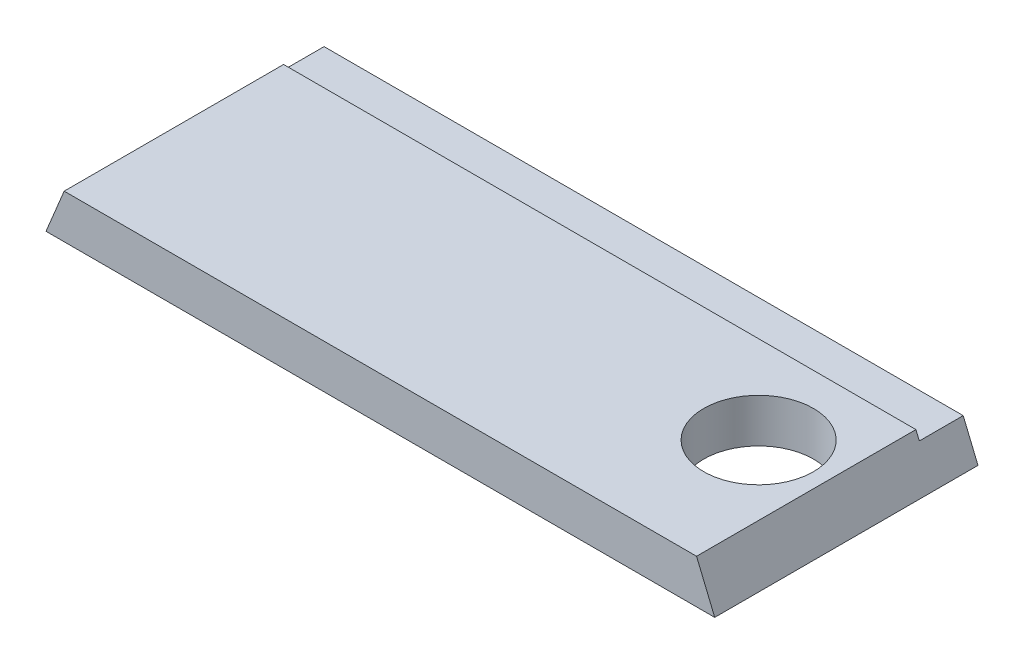
ISO-10303-21;
HEADER;
FILE_DESCRIPTION(('STEP AP214'),'2;1');
FILE_NAME('part.step','',(''),(''),'','','');
FILE_SCHEMA(('AUTOMOTIVE_DESIGN { 1 0 10303 214 1 1 1 1 }'));
ENDSEC;
DATA;
#1=APPLICATION_CONTEXT('core data for automotive mechanical design processes');
#2=APPLICATION_PROTOCOL_DEFINITION('international standard','automotive_design',2000,#1);
#3=PRODUCT_CONTEXT('',#1,'mechanical');
#4=PRODUCT('Part','Part','',(#3));
#5=PRODUCT_RELATED_PRODUCT_CATEGORY('part','',(#4));
#6=PRODUCT_DEFINITION_FORMATION('','',#4);
#7=PRODUCT_DEFINITION_CONTEXT('part definition',#1,'design');
#8=PRODUCT_DEFINITION('design','',#6,#7);
#9=PRODUCT_DEFINITION_SHAPE('','',#8);
#10=(LENGTH_UNIT() NAMED_UNIT(*) SI_UNIT(.MILLI.,.METRE.));
#11=(NAMED_UNIT(*) PLANE_ANGLE_UNIT() SI_UNIT($,.RADIAN.));
#12=(NAMED_UNIT(*) SI_UNIT($,.STERADIAN.) SOLID_ANGLE_UNIT());
#13=UNCERTAINTY_MEASURE_WITH_UNIT(LENGTH_MEASURE(1.E-05),#10,'distance_accuracy_value','');
#14=(GEOMETRIC_REPRESENTATION_CONTEXT(3) GLOBAL_UNCERTAINTY_ASSIGNED_CONTEXT((#13)) GLOBAL_UNIT_ASSIGNED_CONTEXT((#10,
#11,#12)) REPRESENTATION_CONTEXT('',''));
#15=CARTESIAN_POINT('',(0.,0.,0.));
#16=DIRECTION('',(0.,0.,1.));
#17=DIRECTION('',(1.,0.,0.));
#18=AXIS2_PLACEMENT_3D('',#15,#16,#17);
#19=CARTESIAN_POINT('',(0.,0.,0.));
#20=DIRECTION('',(0.,0.,1.));
#21=DIRECTION('',(1.,0.,0.));
#22=AXIS2_PLACEMENT_3D('',#19,#20,#21);
#23=PLANE('',#22);
#24=DIRECTION('',(-1.,0.,0.));
#25=VECTOR('',#24,1.);
#26=CARTESIAN_POINT('',(0.,10.3378,0.));
#27=LINE('',#26,#25);
#28=CARTESIAN_POINT('',(189.265943034899,10.3378,0.));
#29=VERTEX_POINT('',#28);
#30=CARTESIAN_POINT('',(4.28205696510064,10.3378,0.));
#31=VERTEX_POINT('',#30);
#32=EDGE_CURVE('E11',#29,#31,#27,.T.);
#33=ORIENTED_EDGE('',*,*,#32,.F.);
#34=DIRECTION('',(-0.382683432365093,0.923879532511285,0.));
#35=VECTOR('',#34,1.);
#36=CARTESIAN_POINT('',(193.548,0.,0.));
#37=LINE('',#36,#35);
#38=CARTESIAN_POINT('',(193.548,0.,0.));
#39=VERTEX_POINT('',#38);
#40=EDGE_CURVE('E124',#39,#29,#37,.T.);
#41=ORIENTED_EDGE('',*,*,#40,.F.);
#42=DIRECTION('',(1.,0.,0.));
#43=VECTOR('',#42,1.);
#44=CARTESIAN_POINT('',(0.,0.,0.));
#45=LINE('',#44,#43);
#46=CARTESIAN_POINT('',(0.,0.,0.));
#47=VERTEX_POINT('',#46);
#48=EDGE_CURVE('E73',#47,#39,#45,.T.);
#49=ORIENTED_EDGE('',*,*,#48,.F.);
#50=DIRECTION('',(-0.382683432365095,-0.923879532511284,0.));
#51=VECTOR('',#50,1.);
#52=CARTESIAN_POINT('',(5.26051224213839,12.7,0.));
#53=LINE('',#52,#51);
#54=EDGE_CURVE('E104',#31,#47,#53,.T.);
#55=ORIENTED_EDGE('',*,*,#54,.F.);
#56=EDGE_LOOP('',(#33,#41,#49,#55));
#57=FACE_BOUND('',#56,.T.);
#58=ADVANCED_FACE('F34',(#57),#23,.F.);
#59=CARTESIAN_POINT('',(5.26051224213839,12.7,76.2));
#60=DIRECTION('',(0.923879532511284,-0.382683432365095,0.));
#61=DIRECTION('',(0.382683432365095,0.923879532511284,0.));
#62=AXIS2_PLACEMENT_3D('',#59,#60,#61);
#63=PLANE('',#62);
#64=DIRECTION('',(0.,0.,-1.));
#65=VECTOR('',#64,1.);
#66=CARTESIAN_POINT('',(5.26051224213839,12.7,76.2));
#67=LINE('',#66,#65);
#68=CARTESIAN_POINT('',(5.26051224213839,12.7,76.2));
#69=VERTEX_POINT('',#68);
#70=CARTESIAN_POINT('',(5.26051224213839,12.7,12.7));
#71=VERTEX_POINT('',#70);
#72=EDGE_CURVE('E110',#69,#71,#67,.T.);
#73=ORIENTED_EDGE('',*,*,#72,.T.);
#74=DIRECTION('',(-0.382683432365095,-0.923879532511284,0.));
#75=VECTOR('',#74,1.);
#76=CARTESIAN_POINT('',(5.26051224213839,12.7,12.7));
#77=LINE('',#76,#75);
#78=CARTESIAN_POINT('',(4.28205696510064,10.3378,12.7));
#79=VERTEX_POINT('',#78);
#80=EDGE_CURVE('E95',#71,#79,#77,.T.);
#81=ORIENTED_EDGE('',*,*,#80,.T.);
#82=DIRECTION('',(0.,0.,1.));
#83=VECTOR('',#82,1.);
#84=CARTESIAN_POINT('',(4.28205696510065,10.3378,76.2));
#85=LINE('',#84,#83);
#86=EDGE_CURVE('E129',#31,#79,#85,.T.);
#87=ORIENTED_EDGE('',*,*,#86,.F.);
#88=ORIENTED_EDGE('',*,*,#54,.T.);
#89=DIRECTION('',(0.,0.,-1.));
#90=VECTOR('',#89,1.);
#91=CARTESIAN_POINT('',(0.,0.,76.2));
#92=LINE('',#91,#90);
#93=CARTESIAN_POINT('',(0.,0.,76.2));
#94=VERTEX_POINT('',#93);
#95=EDGE_CURVE('E42',#94,#47,#92,.T.);
#96=ORIENTED_EDGE('',*,*,#95,.F.);
#97=DIRECTION('',(-0.382683432365095,-0.923879532511284,0.));
#98=VECTOR('',#97,1.);
#99=CARTESIAN_POINT('',(5.26051224213839,12.7,76.2));
#100=LINE('',#99,#98);
#101=EDGE_CURVE('E117',#69,#94,#100,.T.);
#102=ORIENTED_EDGE('',*,*,#101,.F.);
#103=EDGE_LOOP('',(#73,#81,#87,#88,#96,#102));
#104=FACE_BOUND('',#103,.T.);
#105=ADVANCED_FACE('F36',(#104),#63,.F.);
#106=CARTESIAN_POINT('',(0.,0.,76.2));
#107=DIRECTION('',(0.,1.,0.));
#108=DIRECTION('',(0.,0.,1.));
#109=AXIS2_PLACEMENT_3D('',#106,#107,#108);
#110=PLANE('',#109);
#111=CARTESIAN_POINT('',(168.148,0.,38.1));
#112=DIRECTION('',(0.,-1.,0.));
#113=DIRECTION('',(0.,0.,-1.));
#114=AXIS2_PLACEMENT_3D('',#111,#112,#113);
#115=CIRCLE('',#114,15.875);
#116=CARTESIAN_POINT('',(168.148,0.,22.225));
#117=VERTEX_POINT('',#116);
#118=EDGE_CURVE('E142',#117,#117,#115,.T.);
#119=ORIENTED_EDGE('',*,*,#118,.F.);
#120=EDGE_LOOP('',(#119));
#121=FACE_BOUND('',#120,.T.);
#122=ORIENTED_EDGE('',*,*,#48,.T.);
#123=DIRECTION('',(0.,0.,-1.));
#124=VECTOR('',#123,1.);
#125=CARTESIAN_POINT('',(193.548,0.,76.2));
#126=LINE('',#125,#124);
#127=CARTESIAN_POINT('',(193.548,0.,76.2));
#128=VERTEX_POINT('',#127);
#129=EDGE_CURVE('E119',#128,#39,#126,.T.);
#130=ORIENTED_EDGE('',*,*,#129,.F.);
#131=DIRECTION('',(1.,0.,0.));
#132=VECTOR('',#131,1.);
#133=CARTESIAN_POINT('',(0.,0.,76.2));
#134=LINE('',#133,#132);
#135=EDGE_CURVE('E78',#94,#128,#134,.T.);
#136=ORIENTED_EDGE('',*,*,#135,.F.);
#137=ORIENTED_EDGE('',*,*,#95,.T.);
#138=EDGE_LOOP('',(#122,#130,#136,#137));
#139=FACE_BOUND('',#138,.T.);
#140=ADVANCED_FACE('F127',(#121,#139),#110,.F.);
#141=CARTESIAN_POINT('',(193.548,0.,76.2));
#142=DIRECTION('',(-0.923879532511286,-0.382683432365093,0.));
#143=DIRECTION('',(0.382683432365093,-0.923879532511285,0.));
#144=AXIS2_PLACEMENT_3D('',#141,#142,#143);
#145=PLANE('',#144);
#146=DIRECTION('',(0.,0.,-1.));
#147=VECTOR('',#146,1.);
#148=CARTESIAN_POINT('',(189.265943034899,10.3378,76.2));
#149=LINE('',#148,#147);
#150=CARTESIAN_POINT('',(189.265943034899,10.3378,12.7));
#151=VERTEX_POINT('',#150);
#152=EDGE_CURVE('E48',#151,#29,#149,.T.);
#153=ORIENTED_EDGE('',*,*,#152,.F.);
#154=DIRECTION('',(-0.382683432365093,0.923879532511285,0.));
#155=VECTOR('',#154,1.);
#156=CARTESIAN_POINT('',(193.548,0.,12.7));
#157=LINE('',#156,#155);
#158=CARTESIAN_POINT('',(188.287487757862,12.7,12.7));
#159=VERTEX_POINT('',#158);
#160=EDGE_CURVE('E105',#151,#159,#157,.T.);
#161=ORIENTED_EDGE('',*,*,#160,.T.);
#162=DIRECTION('',(0.,0.,-1.));
#163=VECTOR('',#162,1.);
#164=CARTESIAN_POINT('',(188.287487757862,12.7,76.2));
#165=LINE('',#164,#163);
#166=CARTESIAN_POINT('',(188.287487757862,12.7,76.2));
#167=VERTEX_POINT('',#166);
#168=EDGE_CURVE('E113',#167,#159,#165,.T.);
#169=ORIENTED_EDGE('',*,*,#168,.F.);
#170=DIRECTION('',(-0.382683432365093,0.923879532511285,0.));
#171=VECTOR('',#170,1.);
#172=CARTESIAN_POINT('',(193.548,0.,76.2));
#173=LINE('',#172,#171);
#174=EDGE_CURVE('E121',#128,#167,#173,.T.);
#175=ORIENTED_EDGE('',*,*,#174,.F.);
#176=ORIENTED_EDGE('',*,*,#129,.T.);
#177=ORIENTED_EDGE('',*,*,#40,.T.);
#178=EDGE_LOOP('',(#153,#161,#169,#175,#176,#177));
#179=FACE_BOUND('',#178,.T.);
#180=ADVANCED_FACE('F157',(#179),#145,.F.);
#181=CARTESIAN_POINT('',(188.287487757862,12.7,76.2));
#182=DIRECTION('',(0.,-1.,0.));
#183=DIRECTION('',(1.,0.,0.));
#184=AXIS2_PLACEMENT_3D('',#181,#182,#183);
#185=PLANE('',#184);
#186=CARTESIAN_POINT('',(168.148,12.7,38.1));
#187=DIRECTION('',(0.,-1.,0.));
#188=DIRECTION('',(0.,0.,-1.));
#189=AXIS2_PLACEMENT_3D('',#186,#187,#188);
#190=CIRCLE('',#189,15.875);
#191=CARTESIAN_POINT('',(168.148,12.7,22.225));
#192=VERTEX_POINT('',#191);
#193=EDGE_CURVE('E114',#192,#192,#190,.T.);
#194=ORIENTED_EDGE('',*,*,#193,.T.);
#195=EDGE_LOOP('',(#194));
#196=FACE_BOUND('',#195,.T.);
#197=ORIENTED_EDGE('',*,*,#168,.T.);
#198=DIRECTION('',(1.,0.,0.));
#199=VECTOR('',#198,1.);
#200=CARTESIAN_POINT('',(193.548,12.7,12.7));
#201=LINE('',#200,#199);
#202=EDGE_CURVE('E98',#71,#159,#201,.T.);
#203=ORIENTED_EDGE('',*,*,#202,.F.);
#204=ORIENTED_EDGE('',*,*,#72,.F.);
#205=DIRECTION('',(-1.,0.,0.));
#206=VECTOR('',#205,1.);
#207=CARTESIAN_POINT('',(188.287487757862,12.7,76.2));
#208=LINE('',#207,#206);
#209=EDGE_CURVE('E57',#167,#69,#208,.T.);
#210=ORIENTED_EDGE('',*,*,#209,.F.);
#211=EDGE_LOOP('',(#197,#203,#204,#210));
#212=FACE_BOUND('',#211,.T.);
#213=ADVANCED_FACE('F109',(#196,#212),#185,.F.);
#214=CARTESIAN_POINT('',(0.,0.,76.2));
#215=DIRECTION('',(0.,0.,1.));
#216=DIRECTION('',(1.,0.,0.));
#217=AXIS2_PLACEMENT_3D('',#214,#215,#216);
#218=PLANE('',#217);
#219=ORIENTED_EDGE('',*,*,#101,.T.);
#220=ORIENTED_EDGE('',*,*,#135,.T.);
#221=ORIENTED_EDGE('',*,*,#174,.T.);
#222=ORIENTED_EDGE('',*,*,#209,.T.);
#223=EDGE_LOOP('',(#219,#220,#221,#222));
#224=FACE_BOUND('',#223,.T.);
#225=ADVANCED_FACE('F170',(#224),#218,.T.);
#226=CARTESIAN_POINT('',(193.548,10.3378,12.7));
#227=DIRECTION('',(0.,0.,1.));
#228=DIRECTION('',(1.,0.,0.));
#229=AXIS2_PLACEMENT_3D('',#226,#227,#228);
#230=PLANE('',#229);
#231=ORIENTED_EDGE('',*,*,#202,.T.);
#232=ORIENTED_EDGE('',*,*,#160,.F.);
#233=DIRECTION('',(1.,0.,0.));
#234=VECTOR('',#233,1.);
#235=CARTESIAN_POINT('',(193.548,10.3378,12.7));
#236=LINE('',#235,#234);
#237=EDGE_CURVE('E100',#79,#151,#236,.T.);
#238=ORIENTED_EDGE('',*,*,#237,.F.);
#239=ORIENTED_EDGE('',*,*,#80,.F.);
#240=EDGE_LOOP('',(#231,#232,#238,#239));
#241=FACE_BOUND('',#240,.T.);
#242=ADVANCED_FACE('F97',(#241),#230,.F.);
#243=CARTESIAN_POINT('',(0.,10.3378,0.));
#244=DIRECTION('',(0.,1.,0.));
#245=DIRECTION('',(-1.,0.,0.));
#246=AXIS2_PLACEMENT_3D('',#243,#244,#245);
#247=PLANE('',#246);
#248=ORIENTED_EDGE('',*,*,#86,.T.);
#249=ORIENTED_EDGE('',*,*,#237,.T.);
#250=ORIENTED_EDGE('',*,*,#152,.T.);
#251=ORIENTED_EDGE('',*,*,#32,.T.);
#252=EDGE_LOOP('',(#248,#249,#250,#251));
#253=FACE_BOUND('',#252,.T.);
#254=ADVANCED_FACE('F152',(#253),#247,.T.);
#255=CARTESIAN_POINT('',(168.148,12.7,38.1));
#256=DIRECTION('',(0.,-1.,0.));
#257=DIRECTION('',(0.,0.,-1.));
#258=AXIS2_PLACEMENT_3D('',#255,#256,#257);
#259=CYLINDRICAL_SURFACE('',#258,15.875);
#260=ORIENTED_EDGE('',*,*,#193,.F.);
#261=EDGE_LOOP('',(#260));
#262=FACE_BOUND('',#261,.T.);
#263=ORIENTED_EDGE('',*,*,#118,.T.);
#264=EDGE_LOOP('',(#263));
#265=FACE_BOUND('',#264,.T.);
#266=ADVANCED_FACE('F149',(#262,#265),#259,.F.);
#267=CLOSED_SHELL('',(#58,#105,#140,#180,#213,#225,#242,#254,#266));
#268=MANIFOLD_SOLID_BREP('B2',#267);
#269=ADVANCED_BREP_SHAPE_REPRESENTATION('',(#18,#268),#14);
#270=SHAPE_DEFINITION_REPRESENTATION(#9,#269);
ENDSEC;
END-ISO-10303-21;
